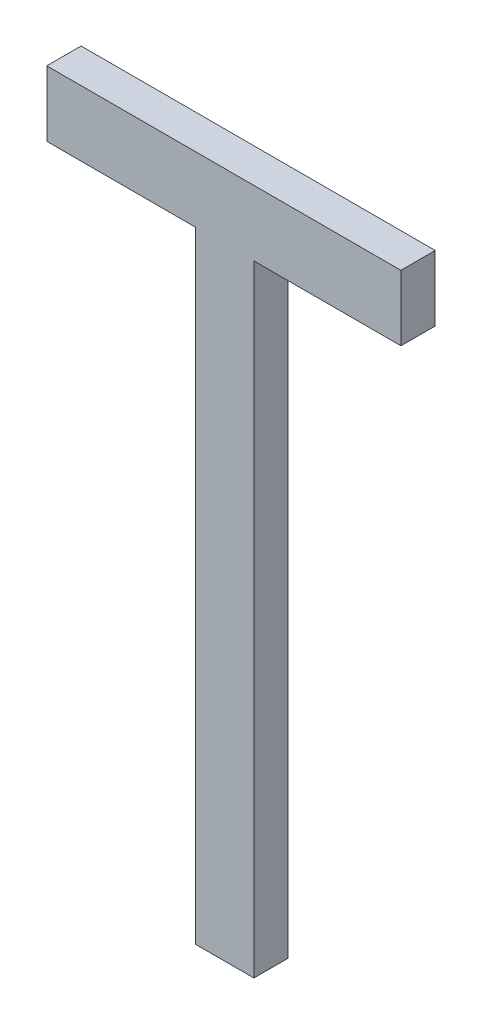
ISO-10303-21;
HEADER;
FILE_DESCRIPTION(('STEP AP214'),'2;1');
FILE_NAME('part.step','',(''),(''),'','','');
FILE_SCHEMA(('AUTOMOTIVE_DESIGN { 1 0 10303 214 1 1 1 1 }'));
ENDSEC;
DATA;
#1=APPLICATION_CONTEXT('core data for automotive mechanical design processes');
#2=APPLICATION_PROTOCOL_DEFINITION('international standard','automotive_design',2000,#1);
#3=PRODUCT_CONTEXT('',#1,'mechanical');
#4=PRODUCT('Part','Part','',(#3));
#5=PRODUCT_RELATED_PRODUCT_CATEGORY('part','',(#4));
#6=PRODUCT_DEFINITION_FORMATION('','',#4);
#7=PRODUCT_DEFINITION_CONTEXT('part definition',#1,'design');
#8=PRODUCT_DEFINITION('design','',#6,#7);
#9=PRODUCT_DEFINITION_SHAPE('','',#8);
#10=(LENGTH_UNIT() NAMED_UNIT(*) SI_UNIT(.MILLI.,.METRE.));
#11=(NAMED_UNIT(*) PLANE_ANGLE_UNIT() SI_UNIT($,.RADIAN.));
#12=(NAMED_UNIT(*) SI_UNIT($,.STERADIAN.) SOLID_ANGLE_UNIT());
#13=UNCERTAINTY_MEASURE_WITH_UNIT(LENGTH_MEASURE(1.E-05),#10,'distance_accuracy_value','');
#14=(GEOMETRIC_REPRESENTATION_CONTEXT(3) GLOBAL_UNCERTAINTY_ASSIGNED_CONTEXT((#13)) GLOBAL_UNIT_ASSIGNED_CONTEXT((#10,
#11,#12)) REPRESENTATION_CONTEXT('',''));
#15=CARTESIAN_POINT('',(0.,0.,0.));
#16=DIRECTION('',(0.,0.,1.));
#17=DIRECTION('',(1.,0.,0.));
#18=AXIS2_PLACEMENT_3D('',#15,#16,#17);
#19=CARTESIAN_POINT('',(183.03959889118,129.252300359681,-38.9997200126349));
#20=DIRECTION('',(0.,0.,-1.));
#21=DIRECTION('',(-1.,0.,0.));
#22=AXIS2_PLACEMENT_3D('',#19,#20,#21);
#23=PLANE('',#22);
#24=DIRECTION('',(0.,1.,0.));
#25=VECTOR('',#24,1.);
#26=CARTESIAN_POINT('',(183.124588169928,129.252300359681,-38.9997200126349));
#27=LINE('',#26,#25);
#28=CARTESIAN_POINT('',(183.124588169928,131.0617233348,-38.9997200126349));
#29=VERTEX_POINT('',#28);
#30=CARTESIAN_POINT('',(183.124588169928,129.252300359681,-38.9997200126349));
#31=VERTEX_POINT('',#30);
#32=EDGE_CURVE('E127',#29,#31,#27,.F.);
#33=ORIENTED_EDGE('',*,*,#32,.F.);
#34=DIRECTION('',(1.,0.,0.));
#35=VECTOR('',#34,1.);
#36=CARTESIAN_POINT('',(183.124588169928,131.0617233348,-38.9997200126349));
#37=LINE('',#36,#35);
#38=CARTESIAN_POINT('',(183.553027273755,131.0617233348,-38.9997200126349));
#39=VERTEX_POINT('',#38);
#40=EDGE_CURVE('E122',#39,#29,#37,.F.);
#41=ORIENTED_EDGE('',*,*,#40,.F.);
#42=DIRECTION('',(0.,1.,0.));
#43=VECTOR('',#42,1.);
#44=CARTESIAN_POINT('',(183.553027273755,131.0617233348,-38.9997200126349));
#45=LINE('',#44,#43);
#46=CARTESIAN_POINT('',(183.553027273755,131.252300359681,-38.9997200126349));
#47=VERTEX_POINT('',#46);
#48=EDGE_CURVE('E116',#47,#39,#45,.F.);
#49=ORIENTED_EDGE('',*,*,#48,.F.);
#50=DIRECTION('',(1.,0.,0.));
#51=VECTOR('',#50,1.);
#52=CARTESIAN_POINT('',(183.553027273755,131.252300359681,-38.9997200126349));
#53=LINE('',#52,#51);
#54=CARTESIAN_POINT('',(182.521125482927,131.252300359681,-38.9997200126349));
#55=VERTEX_POINT('',#54);
#56=EDGE_CURVE('E110',#55,#47,#53,.T.);
#57=ORIENTED_EDGE('',*,*,#56,.F.);
#58=DIRECTION('',(0.,1.,0.));
#59=VECTOR('',#58,1.);
#60=CARTESIAN_POINT('',(182.521125482927,131.252300359681,-38.9997200126349));
#61=LINE('',#60,#59);
#62=CARTESIAN_POINT('',(182.521125482927,131.0617233348,-38.9997200126349));
#63=VERTEX_POINT('',#62);
#64=EDGE_CURVE('E104',#63,#55,#61,.T.);
#65=ORIENTED_EDGE('',*,*,#64,.F.);
#66=DIRECTION('',(1.,0.,0.));
#67=VECTOR('',#66,1.);
#68=CARTESIAN_POINT('',(182.521125482927,131.0617233348,-38.9997200126349));
#69=LINE('',#68,#67);
#70=CARTESIAN_POINT('',(182.954609612432,131.0617233348,-38.9997200126349));
#71=VERTEX_POINT('',#70);
#72=EDGE_CURVE('E80',#71,#63,#69,.F.);
#73=ORIENTED_EDGE('',*,*,#72,.F.);
#74=DIRECTION('',(0.,1.,0.));
#75=VECTOR('',#74,1.);
#76=CARTESIAN_POINT('',(182.954609612432,131.0617233348,-38.9997200126349));
#77=LINE('',#76,#75);
#78=CARTESIAN_POINT('',(182.954609612432,129.252300359681,-38.9997200126349));
#79=VERTEX_POINT('',#78);
#80=EDGE_CURVE('E82',#79,#71,#77,.T.);
#81=ORIENTED_EDGE('',*,*,#80,.F.);
#82=DIRECTION('',(1.,0.,0.));
#83=VECTOR('',#82,1.);
#84=CARTESIAN_POINT('',(182.954609612432,129.252300359681,-38.9997200126349));
#85=LINE('',#84,#83);
#86=EDGE_CURVE('E20',#31,#79,#85,.F.);
#87=ORIENTED_EDGE('',*,*,#86,.F.);
#88=EDGE_LOOP('',(#33,#41,#49,#57,#65,#73,#81,#87));
#89=FACE_BOUND('',#88,.T.);
#90=ADVANCED_FACE('F17',(#89),#23,.F.);
#91=CARTESIAN_POINT('',(182.954609612432,129.252300359681,-39.0997200126349));
#92=DIRECTION('',(0.,-1.,0.));
#93=DIRECTION('',(0.,0.,-1.));
#94=AXIS2_PLACEMENT_3D('',#91,#92,#93);
#95=PLANE('',#94);
#96=DIRECTION('',(-1.,0.,0.));
#97=VECTOR('',#96,1.);
#98=CARTESIAN_POINT('',(183.03959889118,129.252300359681,-39.0997200126349));
#99=LINE('',#98,#97);
#100=CARTESIAN_POINT('',(183.124588169928,129.252300359681,-39.0997200126349));
#101=VERTEX_POINT('',#100);
#102=CARTESIAN_POINT('',(182.954609612432,129.252300359681,-39.0997200126349));
#103=VERTEX_POINT('',#102);
#104=EDGE_CURVE('E131',#101,#103,#99,.T.);
#105=ORIENTED_EDGE('',*,*,#104,.F.);
#106=DIRECTION('',(0.,0.,-1.));
#107=VECTOR('',#106,1.);
#108=CARTESIAN_POINT('',(183.124588169928,129.252300359681,-39.0997200126349));
#109=LINE('',#108,#107);
#110=EDGE_CURVE('E93',#31,#101,#109,.T.);
#111=ORIENTED_EDGE('',*,*,#110,.F.);
#112=ORIENTED_EDGE('',*,*,#86,.T.);
#113=DIRECTION('',(0.,0.,1.));
#114=VECTOR('',#113,1.);
#115=CARTESIAN_POINT('',(182.954609612432,129.252300359681,-39.0997200126349));
#116=LINE('',#115,#114);
#117=EDGE_CURVE('E88',#103,#79,#116,.T.);
#118=ORIENTED_EDGE('',*,*,#117,.F.);
#119=EDGE_LOOP('',(#105,#111,#112,#118));
#120=FACE_BOUND('',#119,.T.);
#121=ADVANCED_FACE('F90',(#120),#95,.T.);
#122=CARTESIAN_POINT('',(182.954609612432,131.0617233348,-39.0997200126349));
#123=DIRECTION('',(-1.,0.,0.));
#124=DIRECTION('',(0.,0.,1.));
#125=AXIS2_PLACEMENT_3D('',#122,#123,#124);
#126=PLANE('',#125);
#127=DIRECTION('',(0.,1.,0.));
#128=VECTOR('',#127,1.);
#129=CARTESIAN_POINT('',(182.954609612432,129.252300359681,-39.0997200126349));
#130=LINE('',#129,#128);
#131=CARTESIAN_POINT('',(182.954609612432,131.0617233348,-39.0997200126349));
#132=VERTEX_POINT('',#131);
#133=EDGE_CURVE('E97',#103,#132,#130,.T.);
#134=ORIENTED_EDGE('',*,*,#133,.F.);
#135=ORIENTED_EDGE('',*,*,#117,.T.);
#136=ORIENTED_EDGE('',*,*,#80,.T.);
#137=DIRECTION('',(0.,0.,-1.));
#138=VECTOR('',#137,1.);
#139=CARTESIAN_POINT('',(182.954609612432,131.0617233348,-39.0997200126349));
#140=LINE('',#139,#138);
#141=EDGE_CURVE('E100',#132,#71,#140,.F.);
#142=ORIENTED_EDGE('',*,*,#141,.F.);
#143=EDGE_LOOP('',(#134,#135,#136,#142));
#144=FACE_BOUND('',#143,.T.);
#145=ADVANCED_FACE('F95',(#144),#126,.T.);
#146=CARTESIAN_POINT('',(182.521125482927,131.0617233348,-39.0997200126349));
#147=DIRECTION('',(0.,-1.,0.));
#148=DIRECTION('',(0.,0.,-1.));
#149=AXIS2_PLACEMENT_3D('',#146,#147,#148);
#150=PLANE('',#149);
#151=DIRECTION('',(-1.,0.,0.));
#152=VECTOR('',#151,1.);
#153=CARTESIAN_POINT('',(183.03959889118,131.0617233348,-39.0997200126349));
#154=LINE('',#153,#152);
#155=CARTESIAN_POINT('',(182.521125482927,131.0617233348,-39.0997200126349));
#156=VERTEX_POINT('',#155);
#157=EDGE_CURVE('E134',#132,#156,#154,.T.);
#158=ORIENTED_EDGE('',*,*,#157,.F.);
#159=ORIENTED_EDGE('',*,*,#141,.T.);
#160=ORIENTED_EDGE('',*,*,#72,.T.);
#161=DIRECTION('',(0.,0.,1.));
#162=VECTOR('',#161,1.);
#163=CARTESIAN_POINT('',(182.521125482927,131.0617233348,-39.0997200126349));
#164=LINE('',#163,#162);
#165=EDGE_CURVE('E107',#156,#63,#164,.T.);
#166=ORIENTED_EDGE('',*,*,#165,.F.);
#167=EDGE_LOOP('',(#158,#159,#160,#166));
#168=FACE_BOUND('',#167,.T.);
#169=ADVANCED_FACE('F161',(#168),#150,.T.);
#170=CARTESIAN_POINT('',(182.521125482927,131.252300359681,-39.0997200126349));
#171=DIRECTION('',(-1.,0.,0.));
#172=DIRECTION('',(0.,0.,1.));
#173=AXIS2_PLACEMENT_3D('',#170,#171,#172);
#174=PLANE('',#173);
#175=DIRECTION('',(0.,1.,0.));
#176=VECTOR('',#175,1.);
#177=CARTESIAN_POINT('',(182.521125482927,129.252300359681,-39.0997200126349));
#178=LINE('',#177,#176);
#179=CARTESIAN_POINT('',(182.521125482927,131.252300359681,-39.0997200126349));
#180=VERTEX_POINT('',#179);
#181=EDGE_CURVE('E137',#156,#180,#178,.T.);
#182=ORIENTED_EDGE('',*,*,#181,.F.);
#183=ORIENTED_EDGE('',*,*,#165,.T.);
#184=ORIENTED_EDGE('',*,*,#64,.T.);
#185=DIRECTION('',(0.,0.,1.));
#186=VECTOR('',#185,1.);
#187=CARTESIAN_POINT('',(182.521125482927,131.252300359681,-39.0997200126349));
#188=LINE('',#187,#186);
#189=EDGE_CURVE('E113',#180,#55,#188,.T.);
#190=ORIENTED_EDGE('',*,*,#189,.F.);
#191=EDGE_LOOP('',(#182,#183,#184,#190));
#192=FACE_BOUND('',#191,.T.);
#193=ADVANCED_FACE('F158',(#192),#174,.T.);
#194=CARTESIAN_POINT('',(183.553027273755,131.252300359681,-39.0997200126349));
#195=DIRECTION('',(0.,1.,0.));
#196=DIRECTION('',(0.,0.,1.));
#197=AXIS2_PLACEMENT_3D('',#194,#195,#196);
#198=PLANE('',#197);
#199=DIRECTION('',(-1.,0.,0.));
#200=VECTOR('',#199,1.);
#201=CARTESIAN_POINT('',(183.03959889118,131.252300359681,-39.0997200126349));
#202=LINE('',#201,#200);
#203=CARTESIAN_POINT('',(183.553027273755,131.252300359681,-39.0997200126349));
#204=VERTEX_POINT('',#203);
#205=EDGE_CURVE('E140',#180,#204,#202,.F.);
#206=ORIENTED_EDGE('',*,*,#205,.F.);
#207=ORIENTED_EDGE('',*,*,#189,.T.);
#208=ORIENTED_EDGE('',*,*,#56,.T.);
#209=DIRECTION('',(0.,0.,-1.));
#210=VECTOR('',#209,1.);
#211=CARTESIAN_POINT('',(183.553027273755,131.252300359681,-39.0997200126349));
#212=LINE('',#211,#210);
#213=EDGE_CURVE('E119',#204,#47,#212,.F.);
#214=ORIENTED_EDGE('',*,*,#213,.F.);
#215=EDGE_LOOP('',(#206,#207,#208,#214));
#216=FACE_BOUND('',#215,.T.);
#217=ADVANCED_FACE('F155',(#216),#198,.T.);
#218=CARTESIAN_POINT('',(183.553027273755,131.0617233348,-39.0997200126349));
#219=DIRECTION('',(1.,0.,0.));
#220=DIRECTION('',(0.,0.,-1.));
#221=AXIS2_PLACEMENT_3D('',#218,#219,#220);
#222=PLANE('',#221);
#223=DIRECTION('',(0.,1.,0.));
#224=VECTOR('',#223,1.);
#225=CARTESIAN_POINT('',(183.553027273755,129.252300359681,-39.0997200126349));
#226=LINE('',#225,#224);
#227=CARTESIAN_POINT('',(183.553027273755,131.0617233348,-39.0997200126349));
#228=VERTEX_POINT('',#227);
#229=EDGE_CURVE('E143',#204,#228,#226,.F.);
#230=ORIENTED_EDGE('',*,*,#229,.F.);
#231=ORIENTED_EDGE('',*,*,#213,.T.);
#232=ORIENTED_EDGE('',*,*,#48,.T.);
#233=DIRECTION('',(0.,0.,-1.));
#234=VECTOR('',#233,1.);
#235=CARTESIAN_POINT('',(183.553027273755,131.0617233348,-39.0997200126349));
#236=LINE('',#235,#234);
#237=EDGE_CURVE('E124',#228,#39,#236,.F.);
#238=ORIENTED_EDGE('',*,*,#237,.F.);
#239=EDGE_LOOP('',(#230,#231,#232,#238));
#240=FACE_BOUND('',#239,.T.);
#241=ADVANCED_FACE('F152',(#240),#222,.T.);
#242=CARTESIAN_POINT('',(183.124588169928,131.0617233348,-39.0997200126349));
#243=DIRECTION('',(0.,-1.,0.));
#244=DIRECTION('',(0.,0.,-1.));
#245=AXIS2_PLACEMENT_3D('',#242,#243,#244);
#246=PLANE('',#245);
#247=DIRECTION('',(-1.,0.,0.));
#248=VECTOR('',#247,1.);
#249=CARTESIAN_POINT('',(183.03959889118,131.0617233348,-39.0997200126349));
#250=LINE('',#249,#248);
#251=CARTESIAN_POINT('',(183.124588169928,131.0617233348,-39.0997200126349));
#252=VERTEX_POINT('',#251);
#253=EDGE_CURVE('E26',#228,#252,#250,.T.);
#254=ORIENTED_EDGE('',*,*,#253,.F.);
#255=ORIENTED_EDGE('',*,*,#237,.T.);
#256=ORIENTED_EDGE('',*,*,#40,.T.);
#257=DIRECTION('',(0.,0.,-1.));
#258=VECTOR('',#257,1.);
#259=CARTESIAN_POINT('',(183.124588169928,131.0617233348,-39.0997200126349));
#260=LINE('',#259,#258);
#261=EDGE_CURVE('E35',#252,#29,#260,.F.);
#262=ORIENTED_EDGE('',*,*,#261,.F.);
#263=EDGE_LOOP('',(#254,#255,#256,#262));
#264=FACE_BOUND('',#263,.T.);
#265=ADVANCED_FACE('F150',(#264),#246,.T.);
#266=CARTESIAN_POINT('',(183.124588169928,129.252300359681,-39.0997200126349));
#267=DIRECTION('',(1.,0.,0.));
#268=DIRECTION('',(0.,0.,-1.));
#269=AXIS2_PLACEMENT_3D('',#266,#267,#268);
#270=PLANE('',#269);
#271=DIRECTION('',(0.,1.,0.));
#272=VECTOR('',#271,1.);
#273=CARTESIAN_POINT('',(183.124588169928,129.252300359681,-39.0997200126349));
#274=LINE('',#273,#272);
#275=EDGE_CURVE('E11',#252,#101,#274,.F.);
#276=ORIENTED_EDGE('',*,*,#275,.F.);
#277=ORIENTED_EDGE('',*,*,#261,.T.);
#278=ORIENTED_EDGE('',*,*,#32,.T.);
#279=ORIENTED_EDGE('',*,*,#110,.T.);
#280=EDGE_LOOP('',(#276,#277,#278,#279));
#281=FACE_BOUND('',#280,.T.);
#282=ADVANCED_FACE('F163',(#281),#270,.T.);
#283=CARTESIAN_POINT('',(183.03959889118,129.252300359681,-39.0997200126349));
#284=DIRECTION('',(0.,0.,-1.));
#285=DIRECTION('',(-1.,0.,0.));
#286=AXIS2_PLACEMENT_3D('',#283,#284,#285);
#287=PLANE('',#286);
#288=ORIENTED_EDGE('',*,*,#253,.T.);
#289=ORIENTED_EDGE('',*,*,#275,.T.);
#290=ORIENTED_EDGE('',*,*,#104,.T.);
#291=ORIENTED_EDGE('',*,*,#133,.T.);
#292=ORIENTED_EDGE('',*,*,#157,.T.);
#293=ORIENTED_EDGE('',*,*,#181,.T.);
#294=ORIENTED_EDGE('',*,*,#205,.T.);
#295=ORIENTED_EDGE('',*,*,#229,.T.);
#296=EDGE_LOOP('',(#288,#289,#290,#291,#292,#293,#294,#295));
#297=FACE_BOUND('',#296,.T.);
#298=ADVANCED_FACE('F148',(#297),#287,.T.);
#299=CLOSED_SHELL('',(#90,#121,#145,#169,#193,#217,#241,#265,#282,#298));
#300=MANIFOLD_SOLID_BREP('B1',#299);
#301=ADVANCED_BREP_SHAPE_REPRESENTATION('',(#18,#300),#14);
#302=SHAPE_DEFINITION_REPRESENTATION(#9,#301);
ENDSEC;
END-ISO-10303-21;
